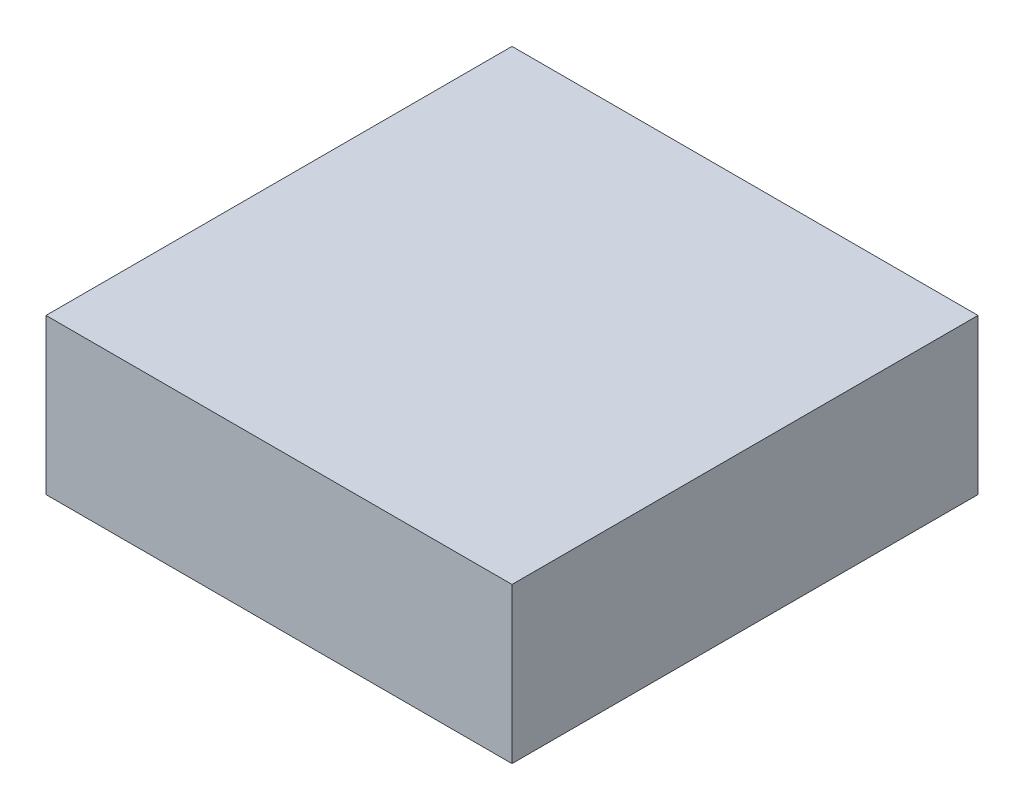
ISO-10303-21;
HEADER;
FILE_DESCRIPTION(('STEP AP214'),'2;1');
FILE_NAME('part.step','',(''),(''),'','','');
FILE_SCHEMA(('AUTOMOTIVE_DESIGN { 1 0 10303 214 1 1 1 1 }'));
ENDSEC;
DATA;
#1=APPLICATION_CONTEXT('core data for automotive mechanical design processes');
#2=APPLICATION_PROTOCOL_DEFINITION('international standard','automotive_design',2000,#1);
#3=PRODUCT_CONTEXT('',#1,'mechanical');
#4=PRODUCT('Part','Part','',(#3));
#5=PRODUCT_RELATED_PRODUCT_CATEGORY('part','',(#4));
#6=PRODUCT_DEFINITION_FORMATION('','',#4);
#7=PRODUCT_DEFINITION_CONTEXT('part definition',#1,'design');
#8=PRODUCT_DEFINITION('design','',#6,#7);
#9=PRODUCT_DEFINITION_SHAPE('','',#8);
#10=(LENGTH_UNIT() NAMED_UNIT(*) SI_UNIT(.MILLI.,.METRE.));
#11=(NAMED_UNIT(*) PLANE_ANGLE_UNIT() SI_UNIT($,.RADIAN.));
#12=(NAMED_UNIT(*) SI_UNIT($,.STERADIAN.) SOLID_ANGLE_UNIT());
#13=UNCERTAINTY_MEASURE_WITH_UNIT(LENGTH_MEASURE(1.E-05),#10,'distance_accuracy_value','');
#14=(GEOMETRIC_REPRESENTATION_CONTEXT(3) GLOBAL_UNCERTAINTY_ASSIGNED_CONTEXT((#13)) GLOBAL_UNIT_ASSIGNED_CONTEXT((#10,
#11,#12)) REPRESENTATION_CONTEXT('',''));
#15=CARTESIAN_POINT('',(0.,0.,0.));
#16=DIRECTION('',(0.,0.,1.));
#17=DIRECTION('',(1.,0.,0.));
#18=AXIS2_PLACEMENT_3D('',#15,#16,#17);
#19=CARTESIAN_POINT('',(-1.25387462762068,6.,8.25057854803682));
#20=DIRECTION('',(0.,1.,0.));
#21=DIRECTION('',(0.,0.,1.));
#22=AXIS2_PLACEMENT_3D('',#19,#20,#21);
#23=PLANE('',#22);
#24=DIRECTION('',(-1.,0.,0.));
#25=VECTOR('',#24,1.);
#26=CARTESIAN_POINT('',(-2.01266380932997,6.,0.910978935867857));
#27=LINE('',#26,#25);
#28=CARTESIAN_POINT('',(-2.01266380932997,6.,0.910978935867857));
#29=VERTEX_POINT('',#28);
#30=CARTESIAN_POINT('',(-2.31295677807997,6.,0.910978935867857));
#31=VERTEX_POINT('',#30);
#32=EDGE_CURVE('E78',#29,#31,#27,.T.);
#33=ORIENTED_EDGE('',*,*,#32,.F.);
#34=DIRECTION('',(0.,0.,-1.));
#35=VECTOR('',#34,1.);
#36=CARTESIAN_POINT('',(-2.01266380932997,6.,1.21127190461786));
#37=LINE('',#36,#35);
#38=CARTESIAN_POINT('',(-2.01266380932997,6.,1.21127190461786));
#39=VERTEX_POINT('',#38);
#40=EDGE_CURVE('E54',#39,#29,#37,.T.);
#41=ORIENTED_EDGE('',*,*,#40,.F.);
#42=DIRECTION('',(1.,0.,0.));
#43=VECTOR('',#42,1.);
#44=CARTESIAN_POINT('',(-2.31295677807997,6.,1.21127190461786));
#45=LINE('',#44,#43);
#46=CARTESIAN_POINT('',(-2.31295677807997,6.,1.21127190461786));
#47=VERTEX_POINT('',#46);
#48=EDGE_CURVE('E56',#47,#39,#45,.T.);
#49=ORIENTED_EDGE('',*,*,#48,.F.);
#50=DIRECTION('',(0.,0.,1.));
#51=VECTOR('',#50,1.);
#52=CARTESIAN_POINT('',(-2.31295677807997,6.,0.910978935867857));
#53=LINE('',#52,#51);
#54=EDGE_CURVE('E19',#31,#47,#53,.T.);
#55=ORIENTED_EDGE('',*,*,#54,.F.);
#56=EDGE_LOOP('',(#33,#41,#49,#55));
#57=FACE_BOUND('',#56,.T.);
#58=ADVANCED_FACE('F16',(#57),#23,.F.);
#59=CARTESIAN_POINT('',(-2.31295677807997,6.,0.910978935867857));
#60=DIRECTION('',(-1.,0.,0.));
#61=DIRECTION('',(0.,0.,1.));
#62=AXIS2_PLACEMENT_3D('',#59,#60,#61);
#63=PLANE('',#62);
#64=DIRECTION('',(0.,0.,1.));
#65=VECTOR('',#64,1.);
#66=CARTESIAN_POINT('',(-2.31295677807997,6.1,8.25057854803682));
#67=LINE('',#66,#65);
#68=CARTESIAN_POINT('',(-2.31295677807997,6.1,0.910978935867857));
#69=VERTEX_POINT('',#68);
#70=CARTESIAN_POINT('',(-2.31295677807997,6.1,1.21127190461786));
#71=VERTEX_POINT('',#70);
#72=EDGE_CURVE('E82',#69,#71,#67,.T.);
#73=ORIENTED_EDGE('',*,*,#72,.F.);
#74=DIRECTION('',(0.,1.,0.));
#75=VECTOR('',#74,1.);
#76=CARTESIAN_POINT('',(-2.31295677807997,6.,0.910978935867857));
#77=LINE('',#76,#75);
#78=EDGE_CURVE('E67',#31,#69,#77,.T.);
#79=ORIENTED_EDGE('',*,*,#78,.F.);
#80=ORIENTED_EDGE('',*,*,#54,.T.);
#81=DIRECTION('',(0.,1.,0.));
#82=VECTOR('',#81,1.);
#83=CARTESIAN_POINT('',(-2.31295677807997,6.,1.21127190461786));
#84=LINE('',#83,#82);
#85=EDGE_CURVE('E62',#71,#47,#84,.F.);
#86=ORIENTED_EDGE('',*,*,#85,.F.);
#87=EDGE_LOOP('',(#73,#79,#80,#86));
#88=FACE_BOUND('',#87,.T.);
#89=ADVANCED_FACE('F64',(#88),#63,.T.);
#90=CARTESIAN_POINT('',(-2.31295677807997,6.,1.21127190461786));
#91=DIRECTION('',(0.,0.,1.));
#92=DIRECTION('',(1.,0.,0.));
#93=AXIS2_PLACEMENT_3D('',#90,#91,#92);
#94=PLANE('',#93);
#95=DIRECTION('',(1.,0.,0.));
#96=VECTOR('',#95,1.);
#97=CARTESIAN_POINT('',(-1.25387462762068,6.1,1.21127190461786));
#98=LINE('',#97,#96);
#99=CARTESIAN_POINT('',(-2.01266380932997,6.1,1.21127190461786));
#100=VERTEX_POINT('',#99);
#101=EDGE_CURVE('E71',#71,#100,#98,.T.);
#102=ORIENTED_EDGE('',*,*,#101,.F.);
#103=ORIENTED_EDGE('',*,*,#85,.T.);
#104=ORIENTED_EDGE('',*,*,#48,.T.);
#105=DIRECTION('',(0.,1.,0.));
#106=VECTOR('',#105,1.);
#107=CARTESIAN_POINT('',(-2.01266380932997,6.,1.21127190461786));
#108=LINE('',#107,#106);
#109=EDGE_CURVE('E74',#100,#39,#108,.F.);
#110=ORIENTED_EDGE('',*,*,#109,.F.);
#111=EDGE_LOOP('',(#102,#103,#104,#110));
#112=FACE_BOUND('',#111,.T.);
#113=ADVANCED_FACE('F69',(#112),#94,.T.);
#114=CARTESIAN_POINT('',(-2.01266380932997,6.,1.21127190461786));
#115=DIRECTION('',(1.,0.,0.));
#116=DIRECTION('',(0.,0.,-1.));
#117=AXIS2_PLACEMENT_3D('',#114,#115,#116);
#118=PLANE('',#117);
#119=DIRECTION('',(0.,0.,1.));
#120=VECTOR('',#119,1.);
#121=CARTESIAN_POINT('',(-2.01266380932997,6.1,8.25057854803682));
#122=LINE('',#121,#120);
#123=CARTESIAN_POINT('',(-2.01266380932997,6.1,0.910978935867857));
#124=VERTEX_POINT('',#123);
#125=EDGE_CURVE('E25',#100,#124,#122,.F.);
#126=ORIENTED_EDGE('',*,*,#125,.F.);
#127=ORIENTED_EDGE('',*,*,#109,.T.);
#128=ORIENTED_EDGE('',*,*,#40,.T.);
#129=DIRECTION('',(0.,1.,0.));
#130=VECTOR('',#129,1.);
#131=CARTESIAN_POINT('',(-2.01266380932997,6.,0.910978935867857));
#132=LINE('',#131,#130);
#133=EDGE_CURVE('E34',#124,#29,#132,.F.);
#134=ORIENTED_EDGE('',*,*,#133,.F.);
#135=EDGE_LOOP('',(#126,#127,#128,#134));
#136=FACE_BOUND('',#135,.T.);
#137=ADVANCED_FACE('F88',(#136),#118,.T.);
#138=CARTESIAN_POINT('',(-2.01266380932997,6.,0.910978935867857));
#139=DIRECTION('',(0.,0.,-1.));
#140=DIRECTION('',(-1.,0.,0.));
#141=AXIS2_PLACEMENT_3D('',#138,#139,#140);
#142=PLANE('',#141);
#143=DIRECTION('',(1.,0.,0.));
#144=VECTOR('',#143,1.);
#145=CARTESIAN_POINT('',(-1.25387462762068,6.1,0.910978935867857));
#146=LINE('',#145,#144);
#147=EDGE_CURVE('E10',#124,#69,#146,.F.);
#148=ORIENTED_EDGE('',*,*,#147,.F.);
#149=ORIENTED_EDGE('',*,*,#133,.T.);
#150=ORIENTED_EDGE('',*,*,#32,.T.);
#151=ORIENTED_EDGE('',*,*,#78,.T.);
#152=EDGE_LOOP('',(#148,#149,#150,#151));
#153=FACE_BOUND('',#152,.T.);
#154=ADVANCED_FACE('F90',(#153),#142,.T.);
#155=CARTESIAN_POINT('',(-1.25387462762068,6.1,8.25057854803682));
#156=DIRECTION('',(0.,1.,0.));
#157=DIRECTION('',(0.,0.,1.));
#158=AXIS2_PLACEMENT_3D('',#155,#156,#157);
#159=PLANE('',#158);
#160=ORIENTED_EDGE('',*,*,#125,.T.);
#161=ORIENTED_EDGE('',*,*,#147,.T.);
#162=ORIENTED_EDGE('',*,*,#72,.T.);
#163=ORIENTED_EDGE('',*,*,#101,.T.);
#164=EDGE_LOOP('',(#160,#161,#162,#163));
#165=FACE_BOUND('',#164,.T.);
#166=ADVANCED_FACE('F87',(#165),#159,.T.);
#167=CLOSED_SHELL('',(#58,#89,#113,#137,#154,#166));
#168=MANIFOLD_SOLID_BREP('B1',#167);
#169=ADVANCED_BREP_SHAPE_REPRESENTATION('',(#18,#168),#14);
#170=SHAPE_DEFINITION_REPRESENTATION(#9,#169);
ENDSEC;
END-ISO-10303-21;
